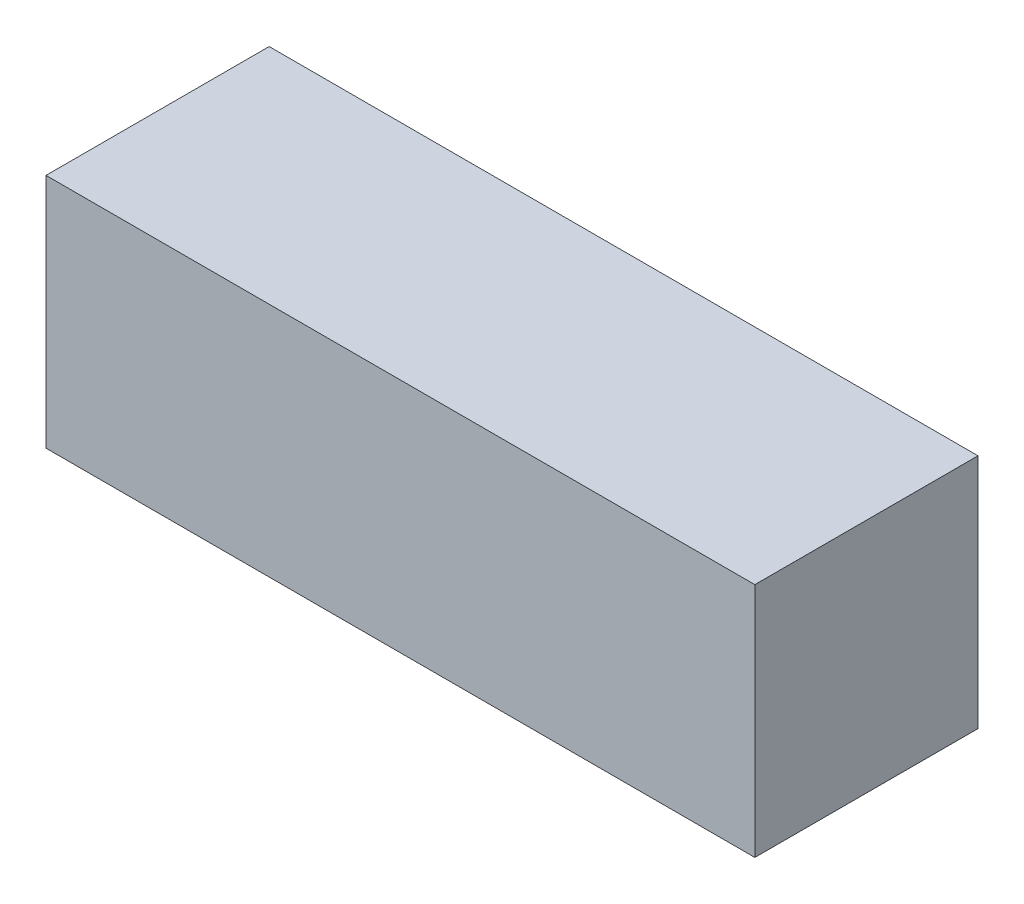
ISO-10303-21;
HEADER;
FILE_DESCRIPTION(('STEP AP214'),'2;1');
FILE_NAME('part.step','',(''),(''),'','','');
FILE_SCHEMA(('AUTOMOTIVE_DESIGN { 1 0 10303 214 1 1 1 1 }'));
ENDSEC;
DATA;
#1=APPLICATION_CONTEXT('core data for automotive mechanical design processes');
#2=APPLICATION_PROTOCOL_DEFINITION('international standard','automotive_design',2000,#1);
#3=PRODUCT_CONTEXT('',#1,'mechanical');
#4=PRODUCT('Part','Part','',(#3));
#5=PRODUCT_RELATED_PRODUCT_CATEGORY('part','',(#4));
#6=PRODUCT_DEFINITION_FORMATION('','',#4);
#7=PRODUCT_DEFINITION_CONTEXT('part definition',#1,'design');
#8=PRODUCT_DEFINITION('design','',#6,#7);
#9=PRODUCT_DEFINITION_SHAPE('','',#8);
#10=(LENGTH_UNIT() NAMED_UNIT(*) SI_UNIT(.MILLI.,.METRE.));
#11=(NAMED_UNIT(*) PLANE_ANGLE_UNIT() SI_UNIT($,.RADIAN.));
#12=(NAMED_UNIT(*) SI_UNIT($,.STERADIAN.) SOLID_ANGLE_UNIT());
#13=UNCERTAINTY_MEASURE_WITH_UNIT(LENGTH_MEASURE(1.E-05),#10,'distance_accuracy_value','');
#14=(GEOMETRIC_REPRESENTATION_CONTEXT(3) GLOBAL_UNCERTAINTY_ASSIGNED_CONTEXT((#13)) GLOBAL_UNIT_ASSIGNED_CONTEXT((#10,
#11,#12)) REPRESENTATION_CONTEXT('',''));
#15=CARTESIAN_POINT('',(0.,0.,0.));
#16=DIRECTION('',(0.,0.,1.));
#17=DIRECTION('',(1.,0.,0.));
#18=AXIS2_PLACEMENT_3D('',#15,#16,#17);
#19=CARTESIAN_POINT('',(27.,18.,8.5));
#20=DIRECTION('',(-1.,0.,0.));
#21=DIRECTION('',(0.,0.,1.));
#22=AXIS2_PLACEMENT_3D('',#19,#20,#21);
#23=PLANE('',#22);
#24=DIRECTION('',(0.,0.,-1.));
#25=VECTOR('',#24,1.);
#26=CARTESIAN_POINT('',(27.,0.,8.5));
#27=LINE('',#26,#25);
#28=CARTESIAN_POINT('',(27.,0.,8.5));
#29=VERTEX_POINT('',#28);
#30=CARTESIAN_POINT('',(27.,0.,-8.5));
#31=VERTEX_POINT('',#30);
#32=EDGE_CURVE('E96',#29,#31,#27,.T.);
#33=ORIENTED_EDGE('',*,*,#32,.T.);
#34=DIRECTION('',(0.,-1.,0.));
#35=VECTOR('',#34,1.);
#36=CARTESIAN_POINT('',(27.,18.,-8.5));
#37=LINE('',#36,#35);
#38=CARTESIAN_POINT('',(27.,18.,-8.5));
#39=VERTEX_POINT('',#38);
#40=EDGE_CURVE('E11',#39,#31,#37,.T.);
#41=ORIENTED_EDGE('',*,*,#40,.F.);
#42=DIRECTION('',(0.,0.,-1.));
#43=VECTOR('',#42,1.);
#44=CARTESIAN_POINT('',(27.,18.,8.5));
#45=LINE('',#44,#43);
#46=CARTESIAN_POINT('',(27.,18.,8.5));
#47=VERTEX_POINT('',#46);
#48=EDGE_CURVE('E84',#47,#39,#45,.T.);
#49=ORIENTED_EDGE('',*,*,#48,.F.);
#50=DIRECTION('',(0.,-1.,0.));
#51=VECTOR('',#50,1.);
#52=CARTESIAN_POINT('',(27.,18.,8.5));
#53=LINE('',#52,#51);
#54=EDGE_CURVE('E92',#47,#29,#53,.T.);
#55=ORIENTED_EDGE('',*,*,#54,.T.);
#56=EDGE_LOOP('',(#33,#41,#49,#55));
#57=FACE_BOUND('',#56,.T.);
#58=ADVANCED_FACE('F33',(#57),#23,.F.);
#59=CARTESIAN_POINT('',(-27.,18.,-8.5));
#60=DIRECTION('',(0.,0.,1.));
#61=DIRECTION('',(1.,0.,0.));
#62=AXIS2_PLACEMENT_3D('',#59,#60,#61);
#63=PLANE('',#62);
#64=DIRECTION('',(-1.,0.,0.));
#65=VECTOR('',#64,1.);
#66=CARTESIAN_POINT('',(-27.,0.,-8.5));
#67=LINE('',#66,#65);
#68=CARTESIAN_POINT('',(-27.,0.,-8.5));
#69=VERTEX_POINT('',#68);
#70=EDGE_CURVE('E88',#31,#69,#67,.T.);
#71=ORIENTED_EDGE('',*,*,#70,.T.);
#72=DIRECTION('',(0.,-1.,0.));
#73=VECTOR('',#72,1.);
#74=CARTESIAN_POINT('',(-27.,18.,-8.5));
#75=LINE('',#74,#73);
#76=CARTESIAN_POINT('',(-27.,18.,-8.5));
#77=VERTEX_POINT('',#76);
#78=EDGE_CURVE('E41',#77,#69,#75,.T.);
#79=ORIENTED_EDGE('',*,*,#78,.F.);
#80=DIRECTION('',(-1.,0.,0.));
#81=VECTOR('',#80,1.);
#82=CARTESIAN_POINT('',(-27.,18.,-8.5));
#83=LINE('',#82,#81);
#84=EDGE_CURVE('E79',#39,#77,#83,.T.);
#85=ORIENTED_EDGE('',*,*,#84,.F.);
#86=ORIENTED_EDGE('',*,*,#40,.T.);
#87=EDGE_LOOP('',(#71,#79,#85,#86));
#88=FACE_BOUND('',#87,.T.);
#89=ADVANCED_FACE('F87',(#88),#63,.F.);
#90=CARTESIAN_POINT('',(-27.,18.,8.5));
#91=DIRECTION('',(1.,0.,0.));
#92=DIRECTION('',(0.,0.,-1.));
#93=AXIS2_PLACEMENT_3D('',#90,#91,#92);
#94=PLANE('',#93);
#95=DIRECTION('',(0.,0.,1.));
#96=VECTOR('',#95,1.);
#97=CARTESIAN_POINT('',(-27.,0.,8.5));
#98=LINE('',#97,#96);
#99=CARTESIAN_POINT('',(-27.,0.,8.5));
#100=VERTEX_POINT('',#99);
#101=EDGE_CURVE('E66',#69,#100,#98,.T.);
#102=ORIENTED_EDGE('',*,*,#101,.T.);
#103=DIRECTION('',(0.,-1.,0.));
#104=VECTOR('',#103,1.);
#105=CARTESIAN_POINT('',(-27.,18.,8.5));
#106=LINE('',#105,#104);
#107=CARTESIAN_POINT('',(-27.,18.,8.5));
#108=VERTEX_POINT('',#107);
#109=EDGE_CURVE('E89',#108,#100,#106,.T.);
#110=ORIENTED_EDGE('',*,*,#109,.F.);
#111=DIRECTION('',(0.,0.,1.));
#112=VECTOR('',#111,1.);
#113=CARTESIAN_POINT('',(-27.,18.,8.5));
#114=LINE('',#113,#112);
#115=EDGE_CURVE('E82',#77,#108,#114,.T.);
#116=ORIENTED_EDGE('',*,*,#115,.F.);
#117=ORIENTED_EDGE('',*,*,#78,.T.);
#118=EDGE_LOOP('',(#102,#110,#116,#117));
#119=FACE_BOUND('',#118,.T.);
#120=ADVANCED_FACE('F90',(#119),#94,.F.);
#121=CARTESIAN_POINT('',(-27.,18.,8.5));
#122=DIRECTION('',(0.,0.,-1.));
#123=DIRECTION('',(-1.,0.,0.));
#124=AXIS2_PLACEMENT_3D('',#121,#122,#123);
#125=PLANE('',#124);
#126=DIRECTION('',(1.,0.,0.));
#127=VECTOR('',#126,1.);
#128=CARTESIAN_POINT('',(-27.,0.,8.5));
#129=LINE('',#128,#127);
#130=EDGE_CURVE('E72',#100,#29,#129,.T.);
#131=ORIENTED_EDGE('',*,*,#130,.T.);
#132=ORIENTED_EDGE('',*,*,#54,.F.);
#133=DIRECTION('',(1.,0.,0.));
#134=VECTOR('',#133,1.);
#135=CARTESIAN_POINT('',(-27.,18.,8.5));
#136=LINE('',#135,#134);
#137=EDGE_CURVE('E49',#108,#47,#136,.T.);
#138=ORIENTED_EDGE('',*,*,#137,.F.);
#139=ORIENTED_EDGE('',*,*,#109,.T.);
#140=EDGE_LOOP('',(#131,#132,#138,#139));
#141=FACE_BOUND('',#140,.T.);
#142=ADVANCED_FACE('F103',(#141),#125,.F.);
#143=CARTESIAN_POINT('',(0.,18.,0.));
#144=DIRECTION('',(0.,-1.,0.));
#145=DIRECTION('',(0.,0.,-1.));
#146=AXIS2_PLACEMENT_3D('',#143,#144,#145);
#147=PLANE('',#146);
#148=ORIENTED_EDGE('',*,*,#48,.T.);
#149=ORIENTED_EDGE('',*,*,#84,.T.);
#150=ORIENTED_EDGE('',*,*,#115,.T.);
#151=ORIENTED_EDGE('',*,*,#137,.T.);
#152=EDGE_LOOP('',(#148,#149,#150,#151));
#153=FACE_BOUND('',#152,.T.);
#154=ADVANCED_FACE('F80',(#153),#147,.F.);
#155=CARTESIAN_POINT('',(0.,0.,0.));
#156=DIRECTION('',(0.,-1.,0.));
#157=DIRECTION('',(0.,0.,-1.));
#158=AXIS2_PLACEMENT_3D('',#155,#156,#157);
#159=PLANE('',#158);
#160=ORIENTED_EDGE('',*,*,#32,.F.);
#161=ORIENTED_EDGE('',*,*,#130,.F.);
#162=ORIENTED_EDGE('',*,*,#101,.F.);
#163=ORIENTED_EDGE('',*,*,#70,.F.);
#164=EDGE_LOOP('',(#160,#161,#162,#163));
#165=FACE_BOUND('',#164,.T.);
#166=ADVANCED_FACE('F106',(#165),#159,.T.);
#167=CLOSED_SHELL('',(#58,#89,#120,#142,#154,#166));
#168=MANIFOLD_SOLID_BREP('B2',#167);
#169=ADVANCED_BREP_SHAPE_REPRESENTATION('',(#18,#168),#14);
#170=SHAPE_DEFINITION_REPRESENTATION(#9,#169);
ENDSEC;
END-ISO-10303-21;
